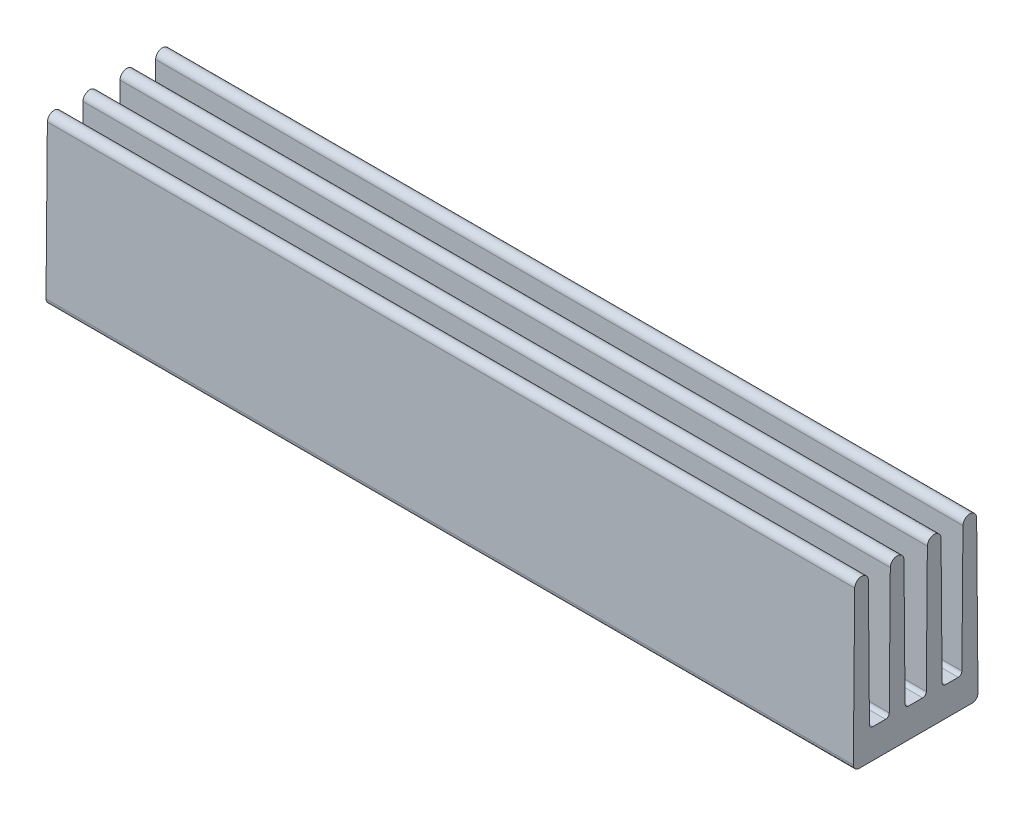
ISO-10303-21;
HEADER;
FILE_DESCRIPTION(('STEP AP214'),'2;1');
FILE_NAME('part.step','',(''),(''),'','','');
FILE_SCHEMA(('AUTOMOTIVE_DESIGN { 1 0 10303 214 1 1 1 1 }'));
ENDSEC;
DATA;
#1=APPLICATION_CONTEXT('core data for automotive mechanical design processes');
#2=APPLICATION_PROTOCOL_DEFINITION('international standard','automotive_design',2000,#1);
#3=PRODUCT_CONTEXT('',#1,'mechanical');
#4=PRODUCT('Part','Part','',(#3));
#5=PRODUCT_RELATED_PRODUCT_CATEGORY('part','',(#4));
#6=PRODUCT_DEFINITION_FORMATION('','',#4);
#7=PRODUCT_DEFINITION_CONTEXT('part definition',#1,'design');
#8=PRODUCT_DEFINITION('design','',#6,#7);
#9=PRODUCT_DEFINITION_SHAPE('','',#8);
#10=(LENGTH_UNIT() NAMED_UNIT(*) SI_UNIT(.MILLI.,.METRE.));
#11=(NAMED_UNIT(*) PLANE_ANGLE_UNIT() SI_UNIT($,.RADIAN.));
#12=(NAMED_UNIT(*) SI_UNIT($,.STERADIAN.) SOLID_ANGLE_UNIT());
#13=UNCERTAINTY_MEASURE_WITH_UNIT(LENGTH_MEASURE(1.E-05),#10,'distance_accuracy_value','');
#14=(GEOMETRIC_REPRESENTATION_CONTEXT(3) GLOBAL_UNCERTAINTY_ASSIGNED_CONTEXT((#13)) GLOBAL_UNIT_ASSIGNED_CONTEXT((#10,
#11,#12)) REPRESENTATION_CONTEXT('',''));
#15=CARTESIAN_POINT('',(0.,0.,0.));
#16=DIRECTION('',(0.,0.,1.));
#17=DIRECTION('',(1.,0.,0.));
#18=AXIS2_PLACEMENT_3D('',#15,#16,#17);
#19=CARTESIAN_POINT('',(27.5,10.7835006819347,-3.68762891330107));
#20=DIRECTION('',(1.,0.,0.));
#21=DIRECTION('',(0.,0.,-1.));
#22=AXIS2_PLACEMENT_3D('',#19,#20,#21);
#23=CYLINDRICAL_SURFACE('',#22,0.466499318065294);
#24=DIRECTION('',(1.,0.,0.));
#25=VECTOR('',#24,1.);
#26=CARTESIAN_POINT('',(-27.5,10.7873871419348,-3.22114578479153));
#27=LINE('',#26,#25);
#28=CARTESIAN_POINT('',(27.5,10.7873871419348,-3.22114578479153));
#29=VERTEX_POINT('',#28);
#30=CARTESIAN_POINT('',(-27.5,10.7873871419348,-3.22114578479153));
#31=VERTEX_POINT('',#30);
#32=EDGE_CURVE('E399',#29,#31,#27,.F.);
#33=ORIENTED_EDGE('',*,*,#32,.F.);
#34=CARTESIAN_POINT('',(27.5,10.7835006819347,-3.68762891330107));
#35=DIRECTION('',(1.,0.,0.));
#36=DIRECTION('',(0.,0.,-1.));
#37=AXIS2_PLACEMENT_3D('',#34,#35,#36);
#38=CIRCLE('',#37,0.466499318065294);
#39=CARTESIAN_POINT('',(27.5,10.7876471787307,-4.15410980285573));
#40=VERTEX_POINT('',#39);
#41=EDGE_CURVE('E407',#40,#29,#38,.T.);
#42=ORIENTED_EDGE('',*,*,#41,.F.);
#43=DIRECTION('',(1.,0.,0.));
#44=VECTOR('',#43,1.);
#45=CARTESIAN_POINT('',(27.5,10.7876471787307,-4.15410980285573));
#46=LINE('',#45,#44);
#47=CARTESIAN_POINT('',(-27.5,10.7876471787307,-4.15410980285573));
#48=VERTEX_POINT('',#47);
#49=EDGE_CURVE('E403',#48,#40,#46,.T.);
#50=ORIENTED_EDGE('',*,*,#49,.F.);
#51=CARTESIAN_POINT('',(-27.5,10.7835006819347,-3.68762891330107));
#52=DIRECTION('',(1.,0.,0.));
#53=DIRECTION('',(0.,0.,-1.));
#54=AXIS2_PLACEMENT_3D('',#51,#52,#53);
#55=CIRCLE('',#54,0.466499318065294);
#56=EDGE_CURVE('E409',#31,#48,#55,.F.);
#57=ORIENTED_EDGE('',*,*,#56,.F.);
#58=EDGE_LOOP('',(#33,#42,#50,#57));
#59=FACE_BOUND('',#58,.T.);
#60=ADVANCED_FACE('F50',(#59),#23,.T.);
#61=CARTESIAN_POINT('',(27.5,10.7836306737387,-1.2625));
#62=DIRECTION('',(1.,0.,0.));
#63=DIRECTION('',(0.,0.,-1.));
#64=AXIS2_PLACEMENT_3D('',#61,#62,#63);
#65=CYLINDRICAL_SURFACE('',#64,0.466369326261257);
#66=DIRECTION('',(1.,0.,0.));
#67=VECTOR('',#66,1.);
#68=CARTESIAN_POINT('',(-27.5,10.787516050762,-0.796146858783211));
#69=LINE('',#68,#67);
#70=CARTESIAN_POINT('',(27.5,10.787516050762,-0.796146858783211));
#71=VERTEX_POINT('',#70);
#72=CARTESIAN_POINT('',(-27.5,10.787516050762,-0.796146858783211));
#73=VERTEX_POINT('',#72);
#74=EDGE_CURVE('E387',#71,#73,#69,.F.);
#75=ORIENTED_EDGE('',*,*,#74,.F.);
#76=CARTESIAN_POINT('',(27.5,10.7836306737387,-1.2625));
#77=DIRECTION('',(1.,0.,0.));
#78=DIRECTION('',(0.,0.,-1.));
#79=AXIS2_PLACEMENT_3D('',#76,#77,#78);
#80=CIRCLE('',#79,0.466369326261257);
#81=CARTESIAN_POINT('',(27.5,10.787516050762,-1.72885314121679));
#82=VERTEX_POINT('',#81);
#83=EDGE_CURVE('E395',#82,#71,#80,.T.);
#84=ORIENTED_EDGE('',*,*,#83,.F.);
#85=DIRECTION('',(1.,0.,0.));
#86=VECTOR('',#85,1.);
#87=CARTESIAN_POINT('',(-27.5,10.787516050762,-1.72885314121679));
#88=LINE('',#87,#86);
#89=CARTESIAN_POINT('',(-27.5,10.787516050762,-1.72885314121679));
#90=VERTEX_POINT('',#89);
#91=EDGE_CURVE('E391',#90,#82,#88,.T.);
#92=ORIENTED_EDGE('',*,*,#91,.F.);
#93=CARTESIAN_POINT('',(-27.5,10.7836306737387,-1.2625));
#94=DIRECTION('',(1.,0.,0.));
#95=DIRECTION('',(0.,0.,-1.));
#96=AXIS2_PLACEMENT_3D('',#93,#94,#95);
#97=CIRCLE('',#96,0.466369326261257);
#98=EDGE_CURVE('E397',#73,#90,#97,.F.);
#99=ORIENTED_EDGE('',*,*,#98,.F.);
#100=EDGE_LOOP('',(#75,#84,#92,#99));
#101=FACE_BOUND('',#100,.T.);
#102=ADVANCED_FACE('F497',(#101),#65,.T.);
#103=CARTESIAN_POINT('',(27.5,10.7836306737387,1.2625));
#104=DIRECTION('',(1.,0.,0.));
#105=DIRECTION('',(0.,0.,-1.));
#106=AXIS2_PLACEMENT_3D('',#103,#104,#105);
#107=CYLINDRICAL_SURFACE('',#106,0.466369326261258);
#108=DIRECTION('',(1.,0.,0.));
#109=VECTOR('',#108,1.);
#110=CARTESIAN_POINT('',(-27.5,10.787516050762,1.72885314121679));
#111=LINE('',#110,#109);
#112=CARTESIAN_POINT('',(27.5,10.787516050762,1.72885314121679));
#113=VERTEX_POINT('',#112);
#114=CARTESIAN_POINT('',(-27.5,10.787516050762,1.72885314121679));
#115=VERTEX_POINT('',#114);
#116=EDGE_CURVE('E375',#113,#115,#111,.F.);
#117=ORIENTED_EDGE('',*,*,#116,.F.);
#118=CARTESIAN_POINT('',(27.5,10.7836306737387,1.2625));
#119=DIRECTION('',(1.,0.,0.));
#120=DIRECTION('',(0.,0.,-1.));
#121=AXIS2_PLACEMENT_3D('',#118,#119,#120);
#122=CIRCLE('',#121,0.466369326261258);
#123=CARTESIAN_POINT('',(27.5,10.787516050762,0.796146858783211));
#124=VERTEX_POINT('',#123);
#125=EDGE_CURVE('E383',#124,#113,#122,.T.);
#126=ORIENTED_EDGE('',*,*,#125,.F.);
#127=DIRECTION('',(1.,0.,0.));
#128=VECTOR('',#127,1.);
#129=CARTESIAN_POINT('',(-27.5,10.787516050762,0.796146858783211));
#130=LINE('',#129,#128);
#131=CARTESIAN_POINT('',(-27.5,10.787516050762,0.796146858783211));
#132=VERTEX_POINT('',#131);
#133=EDGE_CURVE('E379',#132,#124,#130,.T.);
#134=ORIENTED_EDGE('',*,*,#133,.F.);
#135=CARTESIAN_POINT('',(-27.5,10.7836306737387,1.2625));
#136=DIRECTION('',(1.,0.,0.));
#137=DIRECTION('',(0.,0.,-1.));
#138=AXIS2_PLACEMENT_3D('',#135,#136,#137);
#139=CIRCLE('',#138,0.466369326261258);
#140=EDGE_CURVE('E385',#115,#132,#139,.F.);
#141=ORIENTED_EDGE('',*,*,#140,.F.);
#142=EDGE_LOOP('',(#117,#126,#134,#141));
#143=FACE_BOUND('',#142,.T.);
#144=ADVANCED_FACE('F472',(#143),#107,.T.);
#145=CARTESIAN_POINT('',(27.5,10.7835006819347,3.68762891330107));
#146=DIRECTION('',(-1.,0.,0.));
#147=DIRECTION('',(0.,0.,1.));
#148=AXIS2_PLACEMENT_3D('',#145,#146,#147);
#149=CYLINDRICAL_SURFACE('',#148,0.466499318065293);
#150=DIRECTION('',(-1.,0.,0.));
#151=VECTOR('',#150,1.);
#152=CARTESIAN_POINT('',(27.5,10.7876471787307,4.15410980285573));
#153=LINE('',#152,#151);
#154=CARTESIAN_POINT('',(27.5,10.7876471787307,4.15410980285573));
#155=VERTEX_POINT('',#154);
#156=CARTESIAN_POINT('',(-27.5,10.7876471787307,4.15410980285573));
#157=VERTEX_POINT('',#156);
#158=EDGE_CURVE('E359',#155,#157,#153,.T.);
#159=ORIENTED_EDGE('',*,*,#158,.F.);
#160=CARTESIAN_POINT('',(27.5,10.7835006819347,3.68762891330107));
#161=DIRECTION('',(1.,0.,0.));
#162=DIRECTION('',(0.,0.,-1.));
#163=AXIS2_PLACEMENT_3D('',#160,#161,#162);
#164=CIRCLE('',#163,0.466499318065293);
#165=CARTESIAN_POINT('',(27.5,10.7873871419348,3.22114578479153));
#166=VERTEX_POINT('',#165);
#167=EDGE_CURVE('E371',#166,#155,#164,.T.);
#168=ORIENTED_EDGE('',*,*,#167,.F.);
#169=DIRECTION('',(-1.,0.,0.));
#170=VECTOR('',#169,1.);
#171=CARTESIAN_POINT('',(-27.5,10.7873871419348,3.22114578479153));
#172=LINE('',#171,#170);
#173=CARTESIAN_POINT('',(-27.5,10.7873871419348,3.22114578479153));
#174=VERTEX_POINT('',#173);
#175=EDGE_CURVE('E368',#174,#166,#172,.F.);
#176=ORIENTED_EDGE('',*,*,#175,.F.);
#177=CARTESIAN_POINT('',(-27.5,10.7835006819347,3.68762891330107));
#178=DIRECTION('',(1.,0.,0.));
#179=DIRECTION('',(0.,0.,-1.));
#180=AXIS2_PLACEMENT_3D('',#177,#178,#179);
#181=CIRCLE('',#180,0.466499318065293);
#182=EDGE_CURVE('E373',#157,#174,#181,.F.);
#183=ORIENTED_EDGE('',*,*,#182,.F.);
#184=EDGE_LOOP('',(#159,#168,#176,#183));
#185=FACE_BOUND('',#184,.T.);
#186=ADVANCED_FACE('F447',(#185),#149,.T.);
#187=CARTESIAN_POINT('',(27.5,11.25,4.15));
#188=DIRECTION('',(0.,-0.00888853774371659,-0.999960496168113));
#189=DIRECTION('',(0.,0.999960496168113,-0.00888853774371659));
#190=AXIS2_PLACEMENT_3D('',#187,#188,#189);
#191=PLANE('',#190);
#192=DIRECTION('',(0.,-0.999960496168113,0.00888853774371659));
#193=VECTOR('',#192,1.);
#194=CARTESIAN_POINT('',(-27.5,11.25,4.15));
#195=LINE('',#194,#193);
#196=CARTESIAN_POINT('',(-27.5,0.403555415097484,4.24641284075469));
#197=VERTEX_POINT('',#196);
#198=EDGE_CURVE('E342',#157,#197,#195,.T.);
#199=ORIENTED_EDGE('',*,*,#198,.T.);
#200=DIRECTION('',(-1.,0.,0.));
#201=VECTOR('',#200,1.);
#202=CARTESIAN_POINT('',(27.5,0.403555415097486,4.24641284075469));
#203=LINE('',#202,#201);
#204=CARTESIAN_POINT('',(27.5,0.403555415097484,4.24641284075469));
#205=VERTEX_POINT('',#204);
#206=EDGE_CURVE('E12',#197,#205,#203,.F.);
#207=ORIENTED_EDGE('',*,*,#206,.T.);
#208=DIRECTION('',(0.,-0.999960496168113,0.00888853774371659));
#209=VECTOR('',#208,1.);
#210=CARTESIAN_POINT('',(27.5,11.25,4.15));
#211=LINE('',#210,#209);
#212=EDGE_CURVE('E352',#155,#205,#211,.T.);
#213=ORIENTED_EDGE('',*,*,#212,.F.);
#214=ORIENTED_EDGE('',*,*,#158,.T.);
#215=EDGE_LOOP('',(#199,#207,#213,#214));
#216=FACE_BOUND('',#215,.T.);
#217=ADVANCED_FACE('F444',(#216),#191,.F.);
#218=CARTESIAN_POINT('',(27.5,0.,4.25));
#219=DIRECTION('',(0.,1.,0.));
#220=DIRECTION('',(0.,0.,1.));
#221=AXIS2_PLACEMENT_3D('',#218,#219,#220);
#222=PLANE('',#221);
#223=DIRECTION('',(0.,0.,-1.));
#224=VECTOR('',#223,1.);
#225=CARTESIAN_POINT('',(-27.5,0.,4.25));
#226=LINE('',#225,#224);
#227=CARTESIAN_POINT('',(-27.5,0.,3.84642864228744));
#228=VERTEX_POINT('',#227);
#229=CARTESIAN_POINT('',(-27.5,0.,-3.84642864228744));
#230=VERTEX_POINT('',#229);
#231=EDGE_CURVE('E362',#228,#230,#226,.T.);
#232=ORIENTED_EDGE('',*,*,#231,.T.);
#233=DIRECTION('',(-1.,0.,0.));
#234=VECTOR('',#233,1.);
#235=CARTESIAN_POINT('',(27.5,0.,-3.84642864228744));
#236=LINE('',#235,#234);
#237=CARTESIAN_POINT('',(27.5,0.,-3.84642864228744));
#238=VERTEX_POINT('',#237);
#239=EDGE_CURVE('E72',#230,#238,#236,.F.);
#240=ORIENTED_EDGE('',*,*,#239,.T.);
#241=DIRECTION('',(0.,0.,-1.));
#242=VECTOR('',#241,1.);
#243=CARTESIAN_POINT('',(27.5,0.,4.25));
#244=LINE('',#243,#242);
#245=CARTESIAN_POINT('',(27.5,0.,3.84642864228744));
#246=VERTEX_POINT('',#245);
#247=EDGE_CURVE('E354',#246,#238,#244,.T.);
#248=ORIENTED_EDGE('',*,*,#247,.F.);
#249=DIRECTION('',(-1.,0.,0.));
#250=VECTOR('',#249,1.);
#251=CARTESIAN_POINT('',(27.5,0.,3.84642864228744));
#252=LINE('',#251,#250);
#253=EDGE_CURVE('E420',#246,#228,#252,.T.);
#254=ORIENTED_EDGE('',*,*,#253,.T.);
#255=EDGE_LOOP('',(#232,#240,#248,#254));
#256=FACE_BOUND('',#255,.T.);
#257=ADVANCED_FACE('F439',(#256),#222,.F.);
#258=CARTESIAN_POINT('',(27.5,0.,-4.25));
#259=DIRECTION('',(0.,-0.00888853774371659,0.999960496168113));
#260=DIRECTION('',(0.,-0.999960496168113,-0.00888853774371659));
#261=AXIS2_PLACEMENT_3D('',#258,#259,#260);
#262=PLANE('',#261);
#263=DIRECTION('',(0.,0.999960496168113,0.00888853774371659));
#264=VECTOR('',#263,1.);
#265=CARTESIAN_POINT('',(27.5,0.,-4.25));
#266=LINE('',#265,#264);
#267=CARTESIAN_POINT('',(27.5,0.403555415097487,-4.24641284075469));
#268=VERTEX_POINT('',#267);
#269=EDGE_CURVE('E357',#268,#40,#266,.T.);
#270=ORIENTED_EDGE('',*,*,#269,.F.);
#271=DIRECTION('',(-1.,0.,0.));
#272=VECTOR('',#271,1.);
#273=CARTESIAN_POINT('',(27.5,0.403555415097487,-4.24641284075469));
#274=LINE('',#273,#272);
#275=CARTESIAN_POINT('',(-27.5,0.403555415097487,-4.24641284075469));
#276=VERTEX_POINT('',#275);
#277=EDGE_CURVE('E412',#268,#276,#274,.T.);
#278=ORIENTED_EDGE('',*,*,#277,.T.);
#279=DIRECTION('',(0.,0.999960496168113,0.00888853774371659));
#280=VECTOR('',#279,1.);
#281=CARTESIAN_POINT('',(-27.5,0.,-4.25));
#282=LINE('',#281,#280);
#283=EDGE_CURVE('E355',#276,#48,#282,.T.);
#284=ORIENTED_EDGE('',*,*,#283,.T.);
#285=ORIENTED_EDGE('',*,*,#49,.T.);
#286=EDGE_LOOP('',(#270,#278,#284,#285));
#287=FACE_BOUND('',#286,.T.);
#288=ADVANCED_FACE('F435',(#287),#262,.F.);
#289=CARTESIAN_POINT('',(27.5,0.,0.));
#290=DIRECTION('',(1.,0.,0.));
#291=DIRECTION('',(0.,0.,-1.));
#292=AXIS2_PLACEMENT_3D('',#289,#290,#291);
#293=PLANE('',#292);
#294=ORIENTED_EDGE('',*,*,#247,.T.);
#295=CARTESIAN_POINT('',(27.5,0.4,-3.84642864228744));
#296=DIRECTION('',(1.,0.,0.));
#297=DIRECTION('',(0.,0.,-1.));
#298=AXIS2_PLACEMENT_3D('',#295,#296,#297);
#299=CIRCLE('',#298,0.4);
#300=EDGE_CURVE('E59',#238,#268,#299,.T.);
#301=ORIENTED_EDGE('',*,*,#300,.T.);
#302=ORIENTED_EDGE('',*,*,#269,.T.);
#303=ORIENTED_EDGE('',*,*,#41,.T.);
#304=DIRECTION('',(0.,0.999965295649698,-0.00833111614440842));
#305=VECTOR('',#304,1.);
#306=CARTESIAN_POINT('',(27.5,2.2479172209639,-3.15));
#307=LINE('',#306,#305);
#308=CARTESIAN_POINT('',(27.5,2.2479172209639,-3.15));
#309=VERTEX_POINT('',#308);
#310=EDGE_CURVE('E249',#309,#29,#307,.T.);
#311=ORIENTED_EDGE('',*,*,#310,.F.);
#312=CARTESIAN_POINT('',(27.5,2.25,-2.90000867608757));
#313=DIRECTION('',(1.,0.,0.));
#314=DIRECTION('',(0.,0.,-1.));
#315=AXIS2_PLACEMENT_3D('',#312,#313,#314);
#316=CIRCLE('',#315,0.25);
#317=CARTESIAN_POINT('',(27.5,2.,-2.90000867608757));
#318=VERTEX_POINT('',#317);
#319=EDGE_CURVE('E257',#318,#309,#316,.T.);
#320=ORIENTED_EDGE('',*,*,#319,.F.);
#321=DIRECTION('',(0.,0.,-1.));
#322=VECTOR('',#321,1.);
#323=CARTESIAN_POINT('',(27.5,2.,-2.04999132391243));
#324=LINE('',#323,#322);
#325=CARTESIAN_POINT('',(27.5,2.,-2.04999132391243));
#326=VERTEX_POINT('',#325);
#327=EDGE_CURVE('E255',#326,#318,#324,.T.);
#328=ORIENTED_EDGE('',*,*,#327,.F.);
#329=CARTESIAN_POINT('',(27.5,2.25,-2.04999132391243));
#330=DIRECTION('',(1.,0.,0.));
#331=DIRECTION('',(0.,0.,-1.));
#332=AXIS2_PLACEMENT_3D('',#329,#330,#331);
#333=CIRCLE('',#332,0.25);
#334=CARTESIAN_POINT('',(27.5,2.2479172209639,-1.8));
#335=VERTEX_POINT('',#334);
#336=EDGE_CURVE('E222',#335,#326,#333,.T.);
#337=ORIENTED_EDGE('',*,*,#336,.F.);
#338=DIRECTION('',(0.,-0.999965295649698,-0.00833111614440842));
#339=VECTOR('',#338,1.);
#340=CARTESIAN_POINT('',(27.5,11.25,-1.725));
#341=LINE('',#340,#339);
#342=EDGE_CURVE('E252',#82,#335,#341,.T.);
#343=ORIENTED_EDGE('',*,*,#342,.F.);
#344=ORIENTED_EDGE('',*,*,#83,.T.);
#345=DIRECTION('',(0.,0.999965295649698,-0.0083311161444083));
#346=VECTOR('',#345,1.);
#347=CARTESIAN_POINT('',(27.5,2.2479172209639,-0.725));
#348=LINE('',#347,#346);
#349=CARTESIAN_POINT('',(27.5,2.2479172209639,-0.725));
#350=VERTEX_POINT('',#349);
#351=EDGE_CURVE('E313',#350,#71,#348,.T.);
#352=ORIENTED_EDGE('',*,*,#351,.F.);
#353=CARTESIAN_POINT('',(27.5,2.25,-0.475008676087575));
#354=DIRECTION('',(1.,0.,0.));
#355=DIRECTION('',(0.,0.,-1.));
#356=AXIS2_PLACEMENT_3D('',#353,#354,#355);
#357=CIRCLE('',#356,0.25);
#358=CARTESIAN_POINT('',(27.5,2.,-0.475008676087575));
#359=VERTEX_POINT('',#358);
#360=EDGE_CURVE('E334',#359,#350,#357,.T.);
#361=ORIENTED_EDGE('',*,*,#360,.F.);
#362=DIRECTION('',(0.,0.,-1.));
#363=VECTOR('',#362,1.);
#364=CARTESIAN_POINT('',(27.5,2.,0.475008676087575));
#365=LINE('',#364,#363);
#366=CARTESIAN_POINT('',(27.5,2.,0.475008676087575));
#367=VERTEX_POINT('',#366);
#368=EDGE_CURVE('E331',#367,#359,#365,.T.);
#369=ORIENTED_EDGE('',*,*,#368,.F.);
#370=CARTESIAN_POINT('',(27.5,2.25,0.475008676087575));
#371=DIRECTION('',(1.,0.,0.));
#372=DIRECTION('',(0.,0.,-1.));
#373=AXIS2_PLACEMENT_3D('',#370,#371,#372);
#374=CIRCLE('',#373,0.25);
#375=CARTESIAN_POINT('',(27.5,2.2479172209639,0.725));
#376=VERTEX_POINT('',#375);
#377=EDGE_CURVE('E328',#376,#367,#374,.T.);
#378=ORIENTED_EDGE('',*,*,#377,.F.);
#379=DIRECTION('',(0.,-0.999965295649698,-0.00833111614440827));
#380=VECTOR('',#379,1.);
#381=CARTESIAN_POINT('',(27.5,11.25,0.8));
#382=LINE('',#381,#380);
#383=EDGE_CURVE('E301',#124,#376,#382,.T.);
#384=ORIENTED_EDGE('',*,*,#383,.F.);
#385=ORIENTED_EDGE('',*,*,#125,.T.);
#386=DIRECTION('',(0.,0.999965295649698,-0.00833111614440842));
#387=VECTOR('',#386,1.);
#388=CARTESIAN_POINT('',(27.5,11.25,1.725));
#389=LINE('',#388,#387);
#390=CARTESIAN_POINT('',(27.5,2.2479172209639,1.8));
#391=VERTEX_POINT('',#390);
#392=EDGE_CURVE('E272',#391,#113,#389,.T.);
#393=ORIENTED_EDGE('',*,*,#392,.F.);
#394=CARTESIAN_POINT('',(27.5,2.25,2.04999132391243));
#395=DIRECTION('',(1.,0.,0.));
#396=DIRECTION('',(0.,0.,1.));
#397=AXIS2_PLACEMENT_3D('',#394,#395,#396);
#398=CIRCLE('',#397,0.25);
#399=CARTESIAN_POINT('',(27.5,2.,2.04999132391243));
#400=VERTEX_POINT('',#399);
#401=EDGE_CURVE('E293',#400,#391,#398,.T.);
#402=ORIENTED_EDGE('',*,*,#401,.F.);
#403=DIRECTION('',(0.,0.,-1.));
#404=VECTOR('',#403,1.);
#405=CARTESIAN_POINT('',(27.5,2.,2.04999132391243));
#406=LINE('',#405,#404);
#407=CARTESIAN_POINT('',(27.5,2.,2.90000867608757));
#408=VERTEX_POINT('',#407);
#409=EDGE_CURVE('E290',#408,#400,#406,.T.);
#410=ORIENTED_EDGE('',*,*,#409,.F.);
#411=CARTESIAN_POINT('',(27.5,2.25,2.90000867608757));
#412=DIRECTION('',(1.,0.,0.));
#413=DIRECTION('',(0.,0.,1.));
#414=AXIS2_PLACEMENT_3D('',#411,#412,#413);
#415=CIRCLE('',#414,0.25);
#416=CARTESIAN_POINT('',(27.5,2.2479172209639,3.15));
#417=VERTEX_POINT('',#416);
#418=EDGE_CURVE('E287',#417,#408,#415,.T.);
#419=ORIENTED_EDGE('',*,*,#418,.F.);
#420=DIRECTION('',(0.,-0.999965295649698,-0.00833111614440842));
#421=VECTOR('',#420,1.);
#422=CARTESIAN_POINT('',(27.5,2.2479172209639,3.15));
#423=LINE('',#422,#421);
#424=EDGE_CURVE('E263',#166,#417,#423,.T.);
#425=ORIENTED_EDGE('',*,*,#424,.F.);
#426=ORIENTED_EDGE('',*,*,#167,.T.);
#427=ORIENTED_EDGE('',*,*,#212,.T.);
#428=CARTESIAN_POINT('',(27.5,0.4,3.84642864228744));
#429=DIRECTION('',(1.,0.,0.));
#430=DIRECTION('',(0.,0.,-1.));
#431=AXIS2_PLACEMENT_3D('',#428,#429,#430);
#432=CIRCLE('',#431,0.4);
#433=EDGE_CURVE('E426',#205,#246,#432,.T.);
#434=ORIENTED_EDGE('',*,*,#433,.T.);
#435=EDGE_LOOP('',(#294,#301,#302,#303,#311,#320,#328,#337,#343,#344,#352,#361,#369,#378,#384,
#385,#393,#402,#410,#419,#425,#426,#427,#434));
#436=FACE_BOUND('',#435,.T.);
#437=ADVANCED_FACE('F430',(#436),#293,.T.);
#438=CARTESIAN_POINT('',(-27.5,0.,0.));
#439=DIRECTION('',(1.,0.,0.));
#440=DIRECTION('',(0.,0.,-1.));
#441=AXIS2_PLACEMENT_3D('',#438,#439,#440);
#442=PLANE('',#441);
#443=ORIENTED_EDGE('',*,*,#283,.F.);
#444=CARTESIAN_POINT('',(-27.5,0.4,-3.84642864228744));
#445=DIRECTION('',(1.,0.,0.));
#446=DIRECTION('',(0.,0.,-1.));
#447=AXIS2_PLACEMENT_3D('',#444,#445,#446);
#448=CIRCLE('',#447,0.4);
#449=EDGE_CURVE('E418',#276,#230,#448,.F.);
#450=ORIENTED_EDGE('',*,*,#449,.T.);
#451=ORIENTED_EDGE('',*,*,#231,.F.);
#452=CARTESIAN_POINT('',(-27.5,0.4,3.84642864228744));
#453=DIRECTION('',(1.,0.,0.));
#454=DIRECTION('',(0.,0.,-1.));
#455=AXIS2_PLACEMENT_3D('',#452,#453,#454);
#456=CIRCLE('',#455,0.4);
#457=EDGE_CURVE('E416',#228,#197,#456,.F.);
#458=ORIENTED_EDGE('',*,*,#457,.T.);
#459=ORIENTED_EDGE('',*,*,#198,.F.);
#460=ORIENTED_EDGE('',*,*,#182,.T.);
#461=DIRECTION('',(0.,-0.999965295649698,-0.00833111614440842));
#462=VECTOR('',#461,1.);
#463=CARTESIAN_POINT('',(-27.5,2.2479172209639,3.15));
#464=LINE('',#463,#462);
#465=CARTESIAN_POINT('',(-27.5,2.2479172209639,3.15));
#466=VERTEX_POINT('',#465);
#467=EDGE_CURVE('E268',#174,#466,#464,.T.);
#468=ORIENTED_EDGE('',*,*,#467,.T.);
#469=CARTESIAN_POINT('',(-27.5,2.25,2.90000867608757));
#470=DIRECTION('',(1.,0.,0.));
#471=DIRECTION('',(0.,0.,1.));
#472=AXIS2_PLACEMENT_3D('',#469,#470,#471);
#473=CIRCLE('',#472,0.25);
#474=CARTESIAN_POINT('',(-27.5,2.,2.90000867608757));
#475=VERTEX_POINT('',#474);
#476=EDGE_CURVE('E271',#466,#475,#473,.T.);
#477=ORIENTED_EDGE('',*,*,#476,.T.);
#478=DIRECTION('',(0.,0.,-1.));
#479=VECTOR('',#478,1.);
#480=CARTESIAN_POINT('',(-27.5,2.,2.04999132391243));
#481=LINE('',#480,#479);
#482=CARTESIAN_POINT('',(-27.5,2.,2.04999132391243));
#483=VERTEX_POINT('',#482);
#484=EDGE_CURVE('E275',#475,#483,#481,.T.);
#485=ORIENTED_EDGE('',*,*,#484,.T.);
#486=CARTESIAN_POINT('',(-27.5,2.25,2.04999132391243));
#487=DIRECTION('',(1.,0.,0.));
#488=DIRECTION('',(0.,0.,1.));
#489=AXIS2_PLACEMENT_3D('',#486,#487,#488);
#490=CIRCLE('',#489,0.25);
#491=CARTESIAN_POINT('',(-27.5,2.2479172209639,1.8));
#492=VERTEX_POINT('',#491);
#493=EDGE_CURVE('E278',#483,#492,#490,.T.);
#494=ORIENTED_EDGE('',*,*,#493,.T.);
#495=DIRECTION('',(0.,0.999965295649698,-0.00833111614440842));
#496=VECTOR('',#495,1.);
#497=CARTESIAN_POINT('',(-27.5,11.25,1.725));
#498=LINE('',#497,#496);
#499=EDGE_CURVE('E281',#492,#115,#498,.T.);
#500=ORIENTED_EDGE('',*,*,#499,.T.);
#501=ORIENTED_EDGE('',*,*,#140,.T.);
#502=DIRECTION('',(0.,-0.999965295649698,-0.00833111614440827));
#503=VECTOR('',#502,1.);
#504=CARTESIAN_POINT('',(-27.5,11.25,0.8));
#505=LINE('',#504,#503);
#506=CARTESIAN_POINT('',(-27.5,2.2479172209639,0.725));
#507=VERTEX_POINT('',#506);
#508=EDGE_CURVE('E309',#132,#507,#505,.T.);
#509=ORIENTED_EDGE('',*,*,#508,.T.);
#510=CARTESIAN_POINT('',(-27.5,2.25,0.475008676087575));
#511=DIRECTION('',(1.,0.,0.));
#512=DIRECTION('',(0.,0.,-1.));
#513=AXIS2_PLACEMENT_3D('',#510,#511,#512);
#514=CIRCLE('',#513,0.25);
#515=CARTESIAN_POINT('',(-27.5,2.,0.475008676087575));
#516=VERTEX_POINT('',#515);
#517=EDGE_CURVE('E312',#507,#516,#514,.T.);
#518=ORIENTED_EDGE('',*,*,#517,.T.);
#519=DIRECTION('',(0.,0.,-1.));
#520=VECTOR('',#519,1.);
#521=CARTESIAN_POINT('',(-27.5,2.,0.475008676087575));
#522=LINE('',#521,#520);
#523=CARTESIAN_POINT('',(-27.5,2.,-0.475008676087575));
#524=VERTEX_POINT('',#523);
#525=EDGE_CURVE('E316',#516,#524,#522,.T.);
#526=ORIENTED_EDGE('',*,*,#525,.T.);
#527=CARTESIAN_POINT('',(-27.5,2.25,-0.475008676087575));
#528=DIRECTION('',(1.,0.,0.));
#529=DIRECTION('',(0.,0.,-1.));
#530=AXIS2_PLACEMENT_3D('',#527,#528,#529);
#531=CIRCLE('',#530,0.25);
#532=CARTESIAN_POINT('',(-27.5,2.2479172209639,-0.725));
#533=VERTEX_POINT('',#532);
#534=EDGE_CURVE('E319',#524,#533,#531,.T.);
#535=ORIENTED_EDGE('',*,*,#534,.T.);
#536=DIRECTION('',(0.,0.999965295649698,-0.0083311161444083));
#537=VECTOR('',#536,1.);
#538=CARTESIAN_POINT('',(-27.5,2.2479172209639,-0.725));
#539=LINE('',#538,#537);
#540=EDGE_CURVE('E322',#533,#73,#539,.T.);
#541=ORIENTED_EDGE('',*,*,#540,.T.);
#542=ORIENTED_EDGE('',*,*,#98,.T.);
#543=DIRECTION('',(0.,-0.999965295649698,-0.00833111614440842));
#544=VECTOR('',#543,1.);
#545=CARTESIAN_POINT('',(-27.5,11.25,-1.725));
#546=LINE('',#545,#544);
#547=CARTESIAN_POINT('',(-27.5,2.2479172209639,-1.8));
#548=VERTEX_POINT('',#547);
#549=EDGE_CURVE('E241',#90,#548,#546,.T.);
#550=ORIENTED_EDGE('',*,*,#549,.T.);
#551=CARTESIAN_POINT('',(-27.5,2.25,-2.04999132391243));
#552=DIRECTION('',(1.,0.,0.));
#553=DIRECTION('',(0.,0.,-1.));
#554=AXIS2_PLACEMENT_3D('',#551,#552,#553);
#555=CIRCLE('',#554,0.25);
#556=CARTESIAN_POINT('',(-27.5,2.,-2.04999132391243));
#557=VERTEX_POINT('',#556);
#558=EDGE_CURVE('E219',#548,#557,#555,.T.);
#559=ORIENTED_EDGE('',*,*,#558,.T.);
#560=DIRECTION('',(0.,0.,-1.));
#561=VECTOR('',#560,1.);
#562=CARTESIAN_POINT('',(-27.5,2.,-2.04999132391243));
#563=LINE('',#562,#561);
#564=CARTESIAN_POINT('',(-27.5,2.,-2.90000867608757));
#565=VERTEX_POINT('',#564);
#566=EDGE_CURVE('E231',#557,#565,#563,.T.);
#567=ORIENTED_EDGE('',*,*,#566,.T.);
#568=CARTESIAN_POINT('',(-27.5,2.25,-2.90000867608757));
#569=DIRECTION('',(1.,0.,0.));
#570=DIRECTION('',(0.,0.,-1.));
#571=AXIS2_PLACEMENT_3D('',#568,#569,#570);
#572=CIRCLE('',#571,0.25);
#573=CARTESIAN_POINT('',(-27.5,2.2479172209639,-3.15));
#574=VERTEX_POINT('',#573);
#575=EDGE_CURVE('E236',#565,#574,#572,.T.);
#576=ORIENTED_EDGE('',*,*,#575,.T.);
#577=DIRECTION('',(0.,0.999965295649698,-0.00833111614440842));
#578=VECTOR('',#577,1.);
#579=CARTESIAN_POINT('',(-27.5,2.2479172209639,-3.15));
#580=LINE('',#579,#578);
#581=EDGE_CURVE('E244',#574,#31,#580,.T.);
#582=ORIENTED_EDGE('',*,*,#581,.T.);
#583=ORIENTED_EDGE('',*,*,#56,.T.);
#584=EDGE_LOOP('',(#443,#450,#451,#458,#459,#460,#468,#477,#485,#494,#500,#501,#509,#518,#526,
#535,#541,#542,#550,#559,#567,#576,#582,#583));
#585=FACE_BOUND('',#584,.T.);
#586=ADVANCED_FACE('F239',(#585),#442,.F.);
#587=CARTESIAN_POINT('',(-27.5,2.2479172209639,-0.725));
#588=DIRECTION('',(0.,-0.0083311161444083,-0.999965295649698));
#589=DIRECTION('',(0.,0.999965295649698,-0.0083311161444083));
#590=AXIS2_PLACEMENT_3D('',#587,#588,#589);
#591=PLANE('',#590);
#592=ORIENTED_EDGE('',*,*,#351,.T.);
#593=ORIENTED_EDGE('',*,*,#74,.T.);
#594=ORIENTED_EDGE('',*,*,#540,.F.);
#595=DIRECTION('',(1.,0.,0.));
#596=VECTOR('',#595,1.);
#597=CARTESIAN_POINT('',(-27.5,2.2479172209639,-0.725));
#598=LINE('',#597,#596);
#599=EDGE_CURVE('E339',#533,#350,#598,.T.);
#600=ORIENTED_EDGE('',*,*,#599,.T.);
#601=EDGE_LOOP('',(#592,#593,#594,#600));
#602=FACE_BOUND('',#601,.T.);
#603=ADVANCED_FACE('F494',(#602),#591,.F.);
#604=CARTESIAN_POINT('',(-27.5,2.25,-0.475008676087575));
#605=DIRECTION('',(1.,0.,0.));
#606=DIRECTION('',(0.,0.,-1.));
#607=AXIS2_PLACEMENT_3D('',#604,#605,#606);
#608=CYLINDRICAL_SURFACE('',#607,0.25);
#609=ORIENTED_EDGE('',*,*,#360,.T.);
#610=ORIENTED_EDGE('',*,*,#599,.F.);
#611=ORIENTED_EDGE('',*,*,#534,.F.);
#612=DIRECTION('',(1.,0.,0.));
#613=VECTOR('',#612,1.);
#614=CARTESIAN_POINT('',(-27.5,2.,-0.475008676087575));
#615=LINE('',#614,#613);
#616=EDGE_CURVE('E343',#524,#359,#615,.T.);
#617=ORIENTED_EDGE('',*,*,#616,.T.);
#618=EDGE_LOOP('',(#609,#610,#611,#617));
#619=FACE_BOUND('',#618,.T.);
#620=ADVANCED_FACE('F492',(#619),#608,.F.);
#621=CARTESIAN_POINT('',(-27.5,2.,0.475008676087575));
#622=DIRECTION('',(0.,-1.,0.));
#623=DIRECTION('',(0.,0.,-1.));
#624=AXIS2_PLACEMENT_3D('',#621,#622,#623);
#625=PLANE('',#624);
#626=ORIENTED_EDGE('',*,*,#368,.T.);
#627=ORIENTED_EDGE('',*,*,#616,.F.);
#628=ORIENTED_EDGE('',*,*,#525,.F.);
#629=DIRECTION('',(1.,0.,0.));
#630=VECTOR('',#629,1.);
#631=CARTESIAN_POINT('',(-27.5,2.,0.475008676087575));
#632=LINE('',#631,#630);
#633=EDGE_CURVE('E346',#516,#367,#632,.T.);
#634=ORIENTED_EDGE('',*,*,#633,.T.);
#635=EDGE_LOOP('',(#626,#627,#628,#634));
#636=FACE_BOUND('',#635,.T.);
#637=ADVANCED_FACE('F488',(#636),#625,.F.);
#638=CARTESIAN_POINT('',(-27.5,2.25,0.475008676087575));
#639=DIRECTION('',(1.,0.,0.));
#640=DIRECTION('',(0.,0.,-1.));
#641=AXIS2_PLACEMENT_3D('',#638,#639,#640);
#642=CYLINDRICAL_SURFACE('',#641,0.25);
#643=ORIENTED_EDGE('',*,*,#377,.T.);
#644=ORIENTED_EDGE('',*,*,#633,.F.);
#645=ORIENTED_EDGE('',*,*,#517,.F.);
#646=DIRECTION('',(1.,0.,0.));
#647=VECTOR('',#646,1.);
#648=CARTESIAN_POINT('',(-27.5,2.2479172209639,0.725));
#649=LINE('',#648,#647);
#650=EDGE_CURVE('E326',#507,#376,#649,.T.);
#651=ORIENTED_EDGE('',*,*,#650,.T.);
#652=EDGE_LOOP('',(#643,#644,#645,#651));
#653=FACE_BOUND('',#652,.T.);
#654=ADVANCED_FACE('F479',(#653),#642,.F.);
#655=CARTESIAN_POINT('',(-27.5,11.25,0.8));
#656=DIRECTION('',(0.,-0.00833111614440827,0.999965295649698));
#657=DIRECTION('',(0.,-0.999965295649698,-0.00833111614440827));
#658=AXIS2_PLACEMENT_3D('',#655,#656,#657);
#659=PLANE('',#658);
#660=ORIENTED_EDGE('',*,*,#508,.F.);
#661=ORIENTED_EDGE('',*,*,#133,.T.);
#662=ORIENTED_EDGE('',*,*,#383,.T.);
#663=ORIENTED_EDGE('',*,*,#650,.F.);
#664=EDGE_LOOP('',(#660,#661,#662,#663));
#665=FACE_BOUND('',#664,.T.);
#666=ADVANCED_FACE('F482',(#665),#659,.F.);
#667=CARTESIAN_POINT('',(-27.5,2.2479172209639,3.15));
#668=DIRECTION('',(0.,-0.00833111614440842,0.999965295649698));
#669=DIRECTION('',(0.,-0.999965295649698,-0.00833111614440842));
#670=AXIS2_PLACEMENT_3D('',#667,#668,#669);
#671=PLANE('',#670);
#672=ORIENTED_EDGE('',*,*,#467,.F.);
#673=ORIENTED_EDGE('',*,*,#175,.T.);
#674=ORIENTED_EDGE('',*,*,#424,.T.);
#675=DIRECTION('',(1.,0.,0.));
#676=VECTOR('',#675,1.);
#677=CARTESIAN_POINT('',(-27.5,2.2479172209639,3.15));
#678=LINE('',#677,#676);
#679=EDGE_CURVE('E285',#466,#417,#678,.T.);
#680=ORIENTED_EDGE('',*,*,#679,.F.);
#681=EDGE_LOOP('',(#672,#673,#674,#680));
#682=FACE_BOUND('',#681,.T.);
#683=ADVANCED_FACE('F453',(#682),#671,.F.);
#684=CARTESIAN_POINT('',(-27.5,11.25,1.725));
#685=DIRECTION('',(0.,-0.00833111614440842,-0.999965295649698));
#686=DIRECTION('',(0.,0.999965295649698,-0.00833111614440842));
#687=AXIS2_PLACEMENT_3D('',#684,#685,#686);
#688=PLANE('',#687);
#689=ORIENTED_EDGE('',*,*,#392,.T.);
#690=ORIENTED_EDGE('',*,*,#116,.T.);
#691=ORIENTED_EDGE('',*,*,#499,.F.);
#692=DIRECTION('',(1.,0.,0.));
#693=VECTOR('',#692,1.);
#694=CARTESIAN_POINT('',(-27.5,2.2479172209639,1.8));
#695=LINE('',#694,#693);
#696=EDGE_CURVE('E298',#492,#391,#695,.T.);
#697=ORIENTED_EDGE('',*,*,#696,.T.);
#698=EDGE_LOOP('',(#689,#690,#691,#697));
#699=FACE_BOUND('',#698,.T.);
#700=ADVANCED_FACE('F469',(#699),#688,.F.);
#701=CARTESIAN_POINT('',(-27.5,2.25,2.04999132391243));
#702=DIRECTION('',(1.,0.,0.));
#703=DIRECTION('',(0.,0.,-1.));
#704=AXIS2_PLACEMENT_3D('',#701,#702,#703);
#705=CYLINDRICAL_SURFACE('',#704,0.25);
#706=ORIENTED_EDGE('',*,*,#401,.T.);
#707=ORIENTED_EDGE('',*,*,#696,.F.);
#708=ORIENTED_EDGE('',*,*,#493,.F.);
#709=DIRECTION('',(1.,0.,0.));
#710=VECTOR('',#709,1.);
#711=CARTESIAN_POINT('',(-27.5,2.,2.04999132391243));
#712=LINE('',#711,#710);
#713=EDGE_CURVE('E302',#483,#400,#712,.T.);
#714=ORIENTED_EDGE('',*,*,#713,.T.);
#715=EDGE_LOOP('',(#706,#707,#708,#714));
#716=FACE_BOUND('',#715,.T.);
#717=ADVANCED_FACE('F466',(#716),#705,.F.);
#718=CARTESIAN_POINT('',(-27.5,2.,2.04999132391243));
#719=DIRECTION('',(0.,-1.,0.));
#720=DIRECTION('',(0.,0.,-1.));
#721=AXIS2_PLACEMENT_3D('',#718,#719,#720);
#722=PLANE('',#721);
#723=ORIENTED_EDGE('',*,*,#409,.T.);
#724=ORIENTED_EDGE('',*,*,#713,.F.);
#725=ORIENTED_EDGE('',*,*,#484,.F.);
#726=DIRECTION('',(1.,0.,0.));
#727=VECTOR('',#726,1.);
#728=CARTESIAN_POINT('',(-27.5,2.,2.90000867608757));
#729=LINE('',#728,#727);
#730=EDGE_CURVE('E305',#475,#408,#729,.T.);
#731=ORIENTED_EDGE('',*,*,#730,.T.);
#732=EDGE_LOOP('',(#723,#724,#725,#731));
#733=FACE_BOUND('',#732,.T.);
#734=ADVANCED_FACE('F461',(#733),#722,.F.);
#735=CARTESIAN_POINT('',(-27.5,2.25,2.90000867608757));
#736=DIRECTION('',(1.,0.,0.));
#737=DIRECTION('',(0.,0.,-1.));
#738=AXIS2_PLACEMENT_3D('',#735,#736,#737);
#739=CYLINDRICAL_SURFACE('',#738,0.25);
#740=ORIENTED_EDGE('',*,*,#418,.T.);
#741=ORIENTED_EDGE('',*,*,#730,.F.);
#742=ORIENTED_EDGE('',*,*,#476,.F.);
#743=ORIENTED_EDGE('',*,*,#679,.T.);
#744=EDGE_LOOP('',(#740,#741,#742,#743));
#745=FACE_BOUND('',#744,.T.);
#746=ADVANCED_FACE('F458',(#745),#739,.F.);
#747=CARTESIAN_POINT('',(-27.5,2.2479172209639,-3.15));
#748=DIRECTION('',(0.,-0.00833111614440842,-0.999965295649698));
#749=DIRECTION('',(0.,0.999965295649698,-0.00833111614440842));
#750=AXIS2_PLACEMENT_3D('',#747,#748,#749);
#751=PLANE('',#750);
#752=ORIENTED_EDGE('',*,*,#310,.T.);
#753=ORIENTED_EDGE('',*,*,#32,.T.);
#754=ORIENTED_EDGE('',*,*,#581,.F.);
#755=DIRECTION('',(1.,0.,0.));
#756=VECTOR('',#755,1.);
#757=CARTESIAN_POINT('',(-27.5,2.2479172209639,-3.15));
#758=LINE('',#757,#756);
#759=EDGE_CURVE('E260',#574,#309,#758,.T.);
#760=ORIENTED_EDGE('',*,*,#759,.T.);
#761=EDGE_LOOP('',(#752,#753,#754,#760));
#762=FACE_BOUND('',#761,.T.);
#763=ADVANCED_FACE('F510',(#762),#751,.F.);
#764=CARTESIAN_POINT('',(-27.5,2.25,-2.90000867608757));
#765=DIRECTION('',(1.,0.,0.));
#766=DIRECTION('',(0.,0.,-1.));
#767=AXIS2_PLACEMENT_3D('',#764,#765,#766);
#768=CYLINDRICAL_SURFACE('',#767,0.25);
#769=ORIENTED_EDGE('',*,*,#319,.T.);
#770=ORIENTED_EDGE('',*,*,#759,.F.);
#771=ORIENTED_EDGE('',*,*,#575,.F.);
#772=DIRECTION('',(1.,0.,0.));
#773=VECTOR('',#772,1.);
#774=CARTESIAN_POINT('',(-27.5,2.,-2.90000867608757));
#775=LINE('',#774,#773);
#776=EDGE_CURVE('E227',#565,#318,#775,.T.);
#777=ORIENTED_EDGE('',*,*,#776,.T.);
#778=EDGE_LOOP('',(#769,#770,#771,#777));
#779=FACE_BOUND('',#778,.T.);
#780=ADVANCED_FACE('F505',(#779),#768,.F.);
#781=CARTESIAN_POINT('',(-27.5,2.,-2.04999132391243));
#782=DIRECTION('',(0.,-1.,0.));
#783=DIRECTION('',(0.,0.,-1.));
#784=AXIS2_PLACEMENT_3D('',#781,#782,#783);
#785=PLANE('',#784);
#786=ORIENTED_EDGE('',*,*,#327,.T.);
#787=ORIENTED_EDGE('',*,*,#776,.F.);
#788=ORIENTED_EDGE('',*,*,#566,.F.);
#789=DIRECTION('',(1.,0.,0.));
#790=VECTOR('',#789,1.);
#791=CARTESIAN_POINT('',(-27.5,2.,-2.04999132391243));
#792=LINE('',#791,#790);
#793=EDGE_CURVE('E214',#557,#326,#792,.T.);
#794=ORIENTED_EDGE('',*,*,#793,.T.);
#795=EDGE_LOOP('',(#786,#787,#788,#794));
#796=FACE_BOUND('',#795,.T.);
#797=ADVANCED_FACE('F232',(#796),#785,.F.);
#798=CARTESIAN_POINT('',(-27.5,2.25,-2.04999132391243));
#799=DIRECTION('',(1.,0.,0.));
#800=DIRECTION('',(0.,0.,-1.));
#801=AXIS2_PLACEMENT_3D('',#798,#799,#800);
#802=CYLINDRICAL_SURFACE('',#801,0.25);
#803=ORIENTED_EDGE('',*,*,#336,.T.);
#804=ORIENTED_EDGE('',*,*,#793,.F.);
#805=ORIENTED_EDGE('',*,*,#558,.F.);
#806=DIRECTION('',(1.,0.,0.));
#807=VECTOR('',#806,1.);
#808=CARTESIAN_POINT('',(-27.5,2.2479172209639,-1.8));
#809=LINE('',#808,#807);
#810=EDGE_CURVE('E228',#548,#335,#809,.T.);
#811=ORIENTED_EDGE('',*,*,#810,.T.);
#812=EDGE_LOOP('',(#803,#804,#805,#811));
#813=FACE_BOUND('',#812,.T.);
#814=ADVANCED_FACE('F216',(#813),#802,.F.);
#815=CARTESIAN_POINT('',(-27.5,11.25,-1.725));
#816=DIRECTION('',(0.,-0.00833111614440842,0.999965295649698));
#817=DIRECTION('',(0.,-0.999965295649698,-0.00833111614440842));
#818=AXIS2_PLACEMENT_3D('',#815,#816,#817);
#819=PLANE('',#818);
#820=ORIENTED_EDGE('',*,*,#549,.F.);
#821=ORIENTED_EDGE('',*,*,#91,.T.);
#822=ORIENTED_EDGE('',*,*,#342,.T.);
#823=ORIENTED_EDGE('',*,*,#810,.F.);
#824=EDGE_LOOP('',(#820,#821,#822,#823));
#825=FACE_BOUND('',#824,.T.);
#826=ADVANCED_FACE('F501',(#825),#819,.F.);
#827=CARTESIAN_POINT('',(27.5,0.4,-3.84642864228744));
#828=DIRECTION('',(-1.,0.,0.));
#829=DIRECTION('',(0.,0.,1.));
#830=AXIS2_PLACEMENT_3D('',#827,#828,#829);
#831=CYLINDRICAL_SURFACE('',#830,0.4);
#832=ORIENTED_EDGE('',*,*,#300,.F.);
#833=ORIENTED_EDGE('',*,*,#239,.F.);
#834=ORIENTED_EDGE('',*,*,#449,.F.);
#835=ORIENTED_EDGE('',*,*,#277,.F.);
#836=EDGE_LOOP('',(#832,#833,#834,#835));
#837=FACE_BOUND('',#836,.T.);
#838=ADVANCED_FACE('F437',(#837),#831,.T.);
#839=CARTESIAN_POINT('',(27.5,0.4,3.84642864228744));
#840=DIRECTION('',(-1.,0.,0.));
#841=DIRECTION('',(0.,0.,1.));
#842=AXIS2_PLACEMENT_3D('',#839,#840,#841);
#843=CYLINDRICAL_SURFACE('',#842,0.4);
#844=ORIENTED_EDGE('',*,*,#433,.F.);
#845=ORIENTED_EDGE('',*,*,#206,.F.);
#846=ORIENTED_EDGE('',*,*,#457,.F.);
#847=ORIENTED_EDGE('',*,*,#253,.F.);
#848=EDGE_LOOP('',(#844,#845,#846,#847));
#849=FACE_BOUND('',#848,.T.);
#850=ADVANCED_FACE('F52',(#849),#843,.T.);
#851=CLOSED_SHELL('',(#60,#102,#144,#186,#217,#257,#288,#437,#586,#603,#620,#637,#654,#666,#683,
#700,#717,#734,#746,#763,#780,#797,#814,#826,#838,#850));
#852=MANIFOLD_SOLID_BREP('B2',#851);
#853=ADVANCED_BREP_SHAPE_REPRESENTATION('',(#18,#852),#14);
#854=SHAPE_DEFINITION_REPRESENTATION(#9,#853);
ENDSEC;
END-ISO-10303-21;
